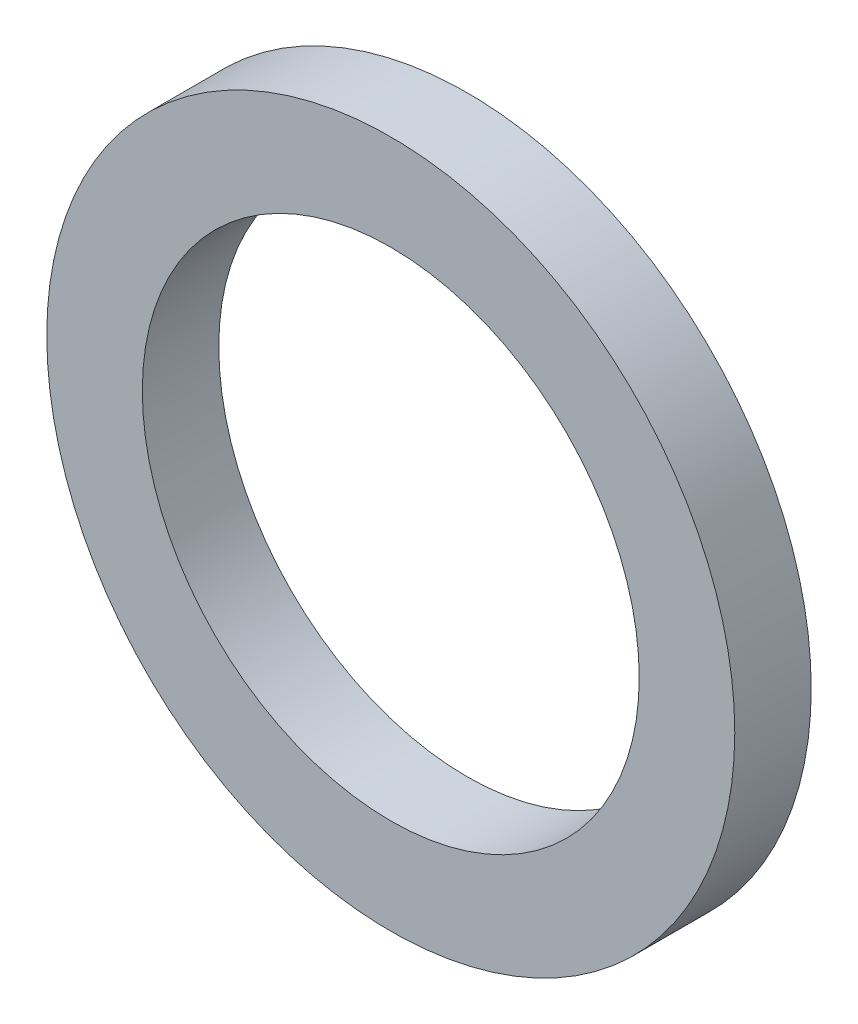
ISO-10303-21;
HEADER;
FILE_DESCRIPTION(('STEP AP214'),'2;1');
FILE_NAME('part.step','',(''),(''),'','','');
FILE_SCHEMA(('AUTOMOTIVE_DESIGN { 1 0 10303 214 1 1 1 1 }'));
ENDSEC;
DATA;
#1=APPLICATION_CONTEXT('core data for automotive mechanical design processes');
#2=APPLICATION_PROTOCOL_DEFINITION('international standard','automotive_design',2000,#1);
#3=PRODUCT_CONTEXT('',#1,'mechanical');
#4=PRODUCT('Part','Part','',(#3));
#5=PRODUCT_RELATED_PRODUCT_CATEGORY('part','',(#4));
#6=PRODUCT_DEFINITION_FORMATION('','',#4);
#7=PRODUCT_DEFINITION_CONTEXT('part definition',#1,'design');
#8=PRODUCT_DEFINITION('design','',#6,#7);
#9=PRODUCT_DEFINITION_SHAPE('','',#8);
#10=(LENGTH_UNIT() NAMED_UNIT(*) SI_UNIT(.MILLI.,.METRE.));
#11=(NAMED_UNIT(*) PLANE_ANGLE_UNIT() SI_UNIT($,.RADIAN.));
#12=(NAMED_UNIT(*) SI_UNIT($,.STERADIAN.) SOLID_ANGLE_UNIT());
#13=UNCERTAINTY_MEASURE_WITH_UNIT(LENGTH_MEASURE(1.E-05),#10,'distance_accuracy_value','');
#14=(GEOMETRIC_REPRESENTATION_CONTEXT(3) GLOBAL_UNCERTAINTY_ASSIGNED_CONTEXT((#13)) GLOBAL_UNIT_ASSIGNED_CONTEXT((#10,
#11,#12)) REPRESENTATION_CONTEXT('',''));
#15=CARTESIAN_POINT('',(0.,0.,0.));
#16=DIRECTION('',(0.,0.,1.));
#17=DIRECTION('',(1.,0.,0.));
#18=AXIS2_PLACEMENT_3D('',#15,#16,#17);
#19=CARTESIAN_POINT('',(0.,0.,1.2));
#20=DIRECTION('',(0.,0.,1.));
#21=DIRECTION('',(1.,0.,0.));
#22=AXIS2_PLACEMENT_3D('',#19,#20,#21);
#23=PLANE('',#22);
#24=CARTESIAN_POINT('',(0.,0.,1.2));
#25=DIRECTION('',(0.,0.,1.));
#26=DIRECTION('',(1.,0.,0.));
#27=AXIS2_PLACEMENT_3D('',#24,#25,#26);
#28=CIRCLE('',#27,5.4);
#29=CARTESIAN_POINT('',(5.4,0.,1.2));
#30=VERTEX_POINT('',#29);
#31=EDGE_CURVE('E10',#30,#30,#28,.T.);
#32=ORIENTED_EDGE('',*,*,#31,.T.);
#33=EDGE_LOOP('',(#32));
#34=FACE_BOUND('',#33,.T.);
#35=CARTESIAN_POINT('',(0.,0.,1.2));
#36=DIRECTION('',(0.,0.,1.));
#37=DIRECTION('',(1.,0.,0.));
#38=AXIS2_PLACEMENT_3D('',#35,#36,#37);
#39=CIRCLE('',#38,3.9);
#40=CARTESIAN_POINT('',(3.9,0.,1.2));
#41=VERTEX_POINT('',#40);
#42=EDGE_CURVE('E43',#41,#41,#39,.T.);
#43=ORIENTED_EDGE('',*,*,#42,.F.);
#44=EDGE_LOOP('',(#43));
#45=FACE_BOUND('',#44,.T.);
#46=ADVANCED_FACE('F32',(#34,#45),#23,.T.);
#47=CARTESIAN_POINT('',(0.,0.,0.));
#48=DIRECTION('',(0.,0.,1.));
#49=DIRECTION('',(1.,0.,0.));
#50=AXIS2_PLACEMENT_3D('',#47,#48,#49);
#51=PLANE('',#50);
#52=CARTESIAN_POINT('',(0.,0.,0.));
#53=DIRECTION('',(0.,0.,1.));
#54=DIRECTION('',(1.,0.,0.));
#55=AXIS2_PLACEMENT_3D('',#52,#53,#54);
#56=CIRCLE('',#55,5.4);
#57=CARTESIAN_POINT('',(5.4,0.,0.));
#58=VERTEX_POINT('',#57);
#59=EDGE_CURVE('E36',#58,#58,#56,.T.);
#60=ORIENTED_EDGE('',*,*,#59,.F.);
#61=EDGE_LOOP('',(#60));
#62=FACE_BOUND('',#61,.T.);
#63=CARTESIAN_POINT('',(0.,0.,0.));
#64=DIRECTION('',(0.,0.,1.));
#65=DIRECTION('',(1.,0.,0.));
#66=AXIS2_PLACEMENT_3D('',#63,#64,#65);
#67=CIRCLE('',#66,3.9);
#68=CARTESIAN_POINT('',(3.9,0.,0.));
#69=VERTEX_POINT('',#68);
#70=EDGE_CURVE('E45',#69,#69,#67,.T.);
#71=ORIENTED_EDGE('',*,*,#70,.T.);
#72=EDGE_LOOP('',(#71));
#73=FACE_BOUND('',#72,.T.);
#74=ADVANCED_FACE('F55',(#62,#73),#51,.F.);
#75=CARTESIAN_POINT('',(0.,0.,1.2));
#76=DIRECTION('',(0.,0.,-1.));
#77=DIRECTION('',(-1.,0.,0.));
#78=AXIS2_PLACEMENT_3D('',#75,#76,#77);
#79=CYLINDRICAL_SURFACE('',#78,5.4);
#80=ORIENTED_EDGE('',*,*,#31,.F.);
#81=EDGE_LOOP('',(#80));
#82=FACE_BOUND('',#81,.T.);
#83=ORIENTED_EDGE('',*,*,#59,.T.);
#84=EDGE_LOOP('',(#83));
#85=FACE_BOUND('',#84,.T.);
#86=ADVANCED_FACE('F34',(#82,#85),#79,.T.);
#87=CARTESIAN_POINT('',(0.,0.,1.2));
#88=DIRECTION('',(0.,0.,-1.));
#89=DIRECTION('',(-1.,0.,0.));
#90=AXIS2_PLACEMENT_3D('',#87,#88,#89);
#91=CYLINDRICAL_SURFACE('',#90,3.9);
#92=ORIENTED_EDGE('',*,*,#42,.T.);
#93=EDGE_LOOP('',(#92));
#94=FACE_BOUND('',#93,.T.);
#95=ORIENTED_EDGE('',*,*,#70,.F.);
#96=EDGE_LOOP('',(#95));
#97=FACE_BOUND('',#96,.T.);
#98=ADVANCED_FACE('F51',(#94,#97),#91,.F.);
#99=CLOSED_SHELL('',(#46,#74,#86,#98));
#100=MANIFOLD_SOLID_BREP('B2',#99);
#101=ADVANCED_BREP_SHAPE_REPRESENTATION('',(#18,#100),#14);
#102=SHAPE_DEFINITION_REPRESENTATION(#9,#101);
ENDSEC;
END-ISO-10303-21;
